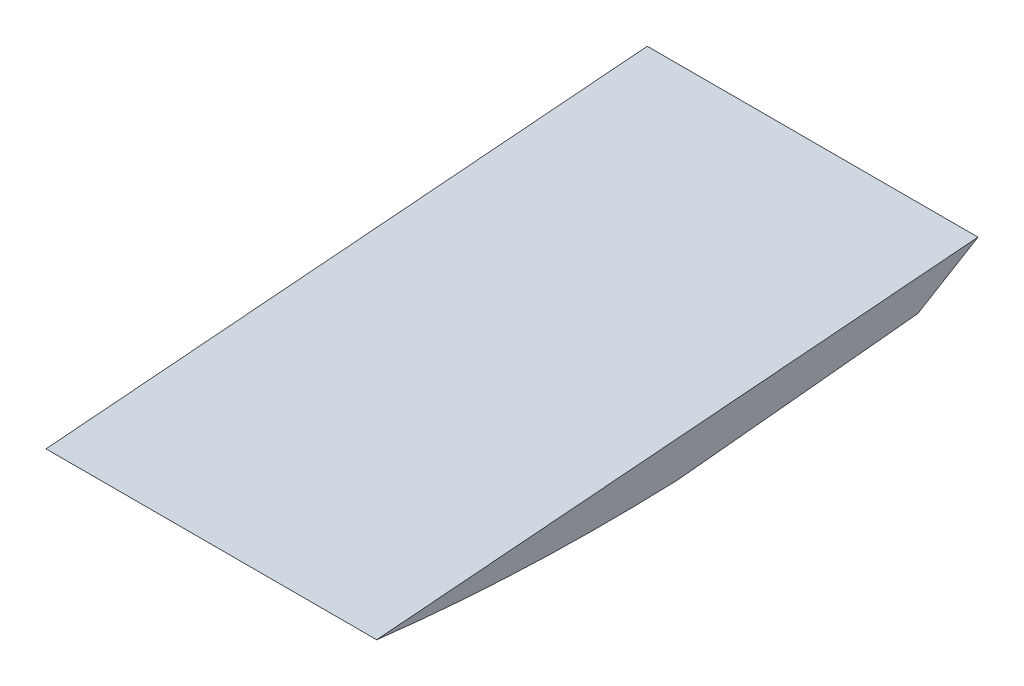
ISO-10303-21;
HEADER;
FILE_DESCRIPTION(('STEP AP214'),'2;1');
FILE_NAME('part.step','',(''),(''),'','','');
FILE_SCHEMA(('AUTOMOTIVE_DESIGN { 1 0 10303 214 1 1 1 1 }'));
ENDSEC;
DATA;
#1=APPLICATION_CONTEXT('core data for automotive mechanical design processes');
#2=APPLICATION_PROTOCOL_DEFINITION('international standard','automotive_design',2000,#1);
#3=PRODUCT_CONTEXT('',#1,'mechanical');
#4=PRODUCT('Part','Part','',(#3));
#5=PRODUCT_RELATED_PRODUCT_CATEGORY('part','',(#4));
#6=PRODUCT_DEFINITION_FORMATION('','',#4);
#7=PRODUCT_DEFINITION_CONTEXT('part definition',#1,'design');
#8=PRODUCT_DEFINITION('design','',#6,#7);
#9=PRODUCT_DEFINITION_SHAPE('','',#8);
#10=(LENGTH_UNIT() NAMED_UNIT(*) SI_UNIT(.MILLI.,.METRE.));
#11=(NAMED_UNIT(*) PLANE_ANGLE_UNIT() SI_UNIT($,.RADIAN.));
#12=(NAMED_UNIT(*) SI_UNIT($,.STERADIAN.) SOLID_ANGLE_UNIT());
#13=UNCERTAINTY_MEASURE_WITH_UNIT(LENGTH_MEASURE(1.E-05),#10,'distance_accuracy_value','');
#14=(GEOMETRIC_REPRESENTATION_CONTEXT(3) GLOBAL_UNCERTAINTY_ASSIGNED_CONTEXT((#13)) GLOBAL_UNIT_ASSIGNED_CONTEXT((#10,
#11,#12)) REPRESENTATION_CONTEXT('',''));
#15=CARTESIAN_POINT('',(0.,0.,0.));
#16=DIRECTION('',(0.,0.,1.));
#17=DIRECTION('',(1.,0.,0.));
#18=AXIS2_PLACEMENT_3D('',#15,#16,#17);
#19=CARTESIAN_POINT('',(13.75,3.,-5.));
#20=DIRECTION('',(0.,0.857492925712544,0.514495755427526));
#21=DIRECTION('',(0.,0.514495755427526,-0.857492925712544));
#22=AXIS2_PLACEMENT_3D('',#19,#20,#21);
#23=PLANE('',#22);
#24=DIRECTION('',(0.,-0.514495755427526,0.857492925712544));
#25=VECTOR('',#24,1.);
#26=CARTESIAN_POINT('',(-13.75,3.,-5.));
#27=LINE('',#26,#25);
#28=CARTESIAN_POINT('',(-13.75,3.,-5.));
#29=VERTEX_POINT('',#28);
#30=CARTESIAN_POINT('',(-13.75,0.,0.));
#31=VERTEX_POINT('',#30);
#32=EDGE_CURVE('E102',#29,#31,#27,.T.);
#33=ORIENTED_EDGE('',*,*,#32,.F.);
#34=DIRECTION('',(-1.,0.,0.));
#35=VECTOR('',#34,1.);
#36=CARTESIAN_POINT('',(13.75,3.,-5.));
#37=LINE('',#36,#35);
#38=CARTESIAN_POINT('',(13.75,3.,-5.));
#39=VERTEX_POINT('',#38);
#40=EDGE_CURVE('E101',#39,#29,#37,.T.);
#41=ORIENTED_EDGE('',*,*,#40,.F.);
#42=DIRECTION('',(0.,-0.514495755427526,0.857492925712544));
#43=VECTOR('',#42,1.);
#44=CARTESIAN_POINT('',(13.75,3.,-5.));
#45=LINE('',#44,#43);
#46=CARTESIAN_POINT('',(13.75,0.,0.));
#47=VERTEX_POINT('',#46);
#48=EDGE_CURVE('E96',#39,#47,#45,.T.);
#49=ORIENTED_EDGE('',*,*,#48,.T.);
#50=DIRECTION('',(-1.,0.,0.));
#51=VECTOR('',#50,1.);
#52=CARTESIAN_POINT('',(13.75,0.,0.));
#53=LINE('',#52,#51);
#54=EDGE_CURVE('E11',#47,#31,#53,.T.);
#55=ORIENTED_EDGE('',*,*,#54,.T.);
#56=EDGE_LOOP('',(#33,#41,#49,#55));
#57=FACE_BOUND('',#56,.T.);
#58=ADVANCED_FACE('F39',(#57),#23,.F.);
#59=CARTESIAN_POINT('',(13.75,0.,0.));
#60=DIRECTION('',(0.,0.995037190209989,0.0995037190209989));
#61=DIRECTION('',(0.,0.0995037190209989,-0.995037190209989));
#62=AXIS2_PLACEMENT_3D('',#59,#60,#61);
#63=PLANE('',#62);
#64=DIRECTION('',(0.,-0.0995037190209989,0.995037190209989));
#65=VECTOR('',#64,1.);
#66=CARTESIAN_POINT('',(-13.75,0.,0.));
#67=LINE('',#66,#65);
#68=CARTESIAN_POINT('',(-13.75,-2.,20.));
#69=VERTEX_POINT('',#68);
#70=EDGE_CURVE('E104',#31,#69,#67,.T.);
#71=ORIENTED_EDGE('',*,*,#70,.F.);
#72=ORIENTED_EDGE('',*,*,#54,.F.);
#73=DIRECTION('',(0.,-0.0995037190209989,0.995037190209989));
#74=VECTOR('',#73,1.);
#75=CARTESIAN_POINT('',(13.75,0.,0.));
#76=LINE('',#75,#74);
#77=CARTESIAN_POINT('',(13.75,-2.,20.));
#78=VERTEX_POINT('',#77);
#79=EDGE_CURVE('E80',#47,#78,#76,.T.);
#80=ORIENTED_EDGE('',*,*,#79,.T.);
#81=DIRECTION('',(-1.,0.,0.));
#82=VECTOR('',#81,1.);
#83=CARTESIAN_POINT('',(13.75,-2.,20.));
#84=LINE('',#83,#82);
#85=EDGE_CURVE('E47',#78,#69,#84,.T.);
#86=ORIENTED_EDGE('',*,*,#85,.T.);
#87=EDGE_LOOP('',(#71,#72,#80,#86));
#88=FACE_BOUND('',#87,.T.);
#89=ADVANCED_FACE('F94',(#88),#63,.F.);
#90=CARTESIAN_POINT('',(13.75,157.88434424532,26.0824719682095));
#91=DIRECTION('',(-1.,0.,0.));
#92=DIRECTION('',(0.,0.,-1.));
#93=AXIS2_PLACEMENT_3D('',#90,#91,#92);
#94=CYLINDRICAL_SURFACE('',#93,160.);
#95=CARTESIAN_POINT('',(-13.75,157.88434424532,26.0824719682095));
#96=DIRECTION('',(-1.,0.,0.));
#97=DIRECTION('',(0.,0.,-1.));
#98=AXIS2_PLACEMENT_3D('',#95,#96,#97);
#99=CIRCLE('',#98,160.);
#100=CARTESIAN_POINT('',(-13.75,-0.993367008230189,45.));
#101=VERTEX_POINT('',#100);
#102=EDGE_CURVE('E90',#69,#101,#99,.T.);
#103=ORIENTED_EDGE('',*,*,#102,.F.);
#104=ORIENTED_EDGE('',*,*,#85,.F.);
#105=CARTESIAN_POINT('',(13.75,157.88434424532,26.0824719682095));
#106=DIRECTION('',(-1.,0.,0.));
#107=DIRECTION('',(0.,0.,-1.));
#108=AXIS2_PLACEMENT_3D('',#105,#106,#107);
#109=CIRCLE('',#108,160.);
#110=CARTESIAN_POINT('',(13.75,-0.993367008230189,45.));
#111=VERTEX_POINT('',#110);
#112=EDGE_CURVE('E83',#78,#111,#109,.T.);
#113=ORIENTED_EDGE('',*,*,#112,.T.);
#114=DIRECTION('',(-1.,0.,0.));
#115=VECTOR('',#114,1.);
#116=CARTESIAN_POINT('',(13.75,-0.993367008230189,45.));
#117=LINE('',#116,#115);
#118=EDGE_CURVE('E93',#111,#101,#117,.T.);
#119=ORIENTED_EDGE('',*,*,#118,.T.);
#120=EDGE_LOOP('',(#103,#104,#113,#119));
#121=FACE_BOUND('',#120,.T.);
#122=ADVANCED_FACE('F89',(#121),#94,.T.);
#123=CARTESIAN_POINT('',(13.75,-0.993367008230173,45.));
#124=DIRECTION('',(0.,-0.996825781699711,-0.0796138237918575));
#125=DIRECTION('',(0.,-0.0796138237918575,0.996825781699711));
#126=AXIS2_PLACEMENT_3D('',#123,#124,#125);
#127=PLANE('',#126);
#128=DIRECTION('',(0.,0.0796138237918575,-0.996825781699711));
#129=VECTOR('',#128,1.);
#130=CARTESIAN_POINT('',(-13.75,-0.993367008230173,45.));
#131=LINE('',#130,#129);
#132=EDGE_CURVE('E69',#101,#29,#131,.T.);
#133=ORIENTED_EDGE('',*,*,#132,.F.);
#134=ORIENTED_EDGE('',*,*,#118,.F.);
#135=DIRECTION('',(0.,0.0796138237918575,-0.996825781699711));
#136=VECTOR('',#135,1.);
#137=CARTESIAN_POINT('',(13.75,-0.993367008230173,45.));
#138=LINE('',#137,#136);
#139=EDGE_CURVE('E55',#111,#39,#138,.T.);
#140=ORIENTED_EDGE('',*,*,#139,.T.);
#141=ORIENTED_EDGE('',*,*,#40,.T.);
#142=EDGE_LOOP('',(#133,#134,#140,#141));
#143=FACE_BOUND('',#142,.T.);
#144=ADVANCED_FACE('F113',(#143),#127,.F.);
#145=CARTESIAN_POINT('',(13.75,157.88434424532,26.0824719682095));
#146=DIRECTION('',(-1.,0.,0.));
#147=DIRECTION('',(0.,0.,-1.));
#148=AXIS2_PLACEMENT_3D('',#145,#146,#147);
#149=PLANE('',#148);
#150=ORIENTED_EDGE('',*,*,#48,.F.);
#151=ORIENTED_EDGE('',*,*,#139,.F.);
#152=ORIENTED_EDGE('',*,*,#112,.F.);
#153=ORIENTED_EDGE('',*,*,#79,.F.);
#154=EDGE_LOOP('',(#150,#151,#152,#153));
#155=FACE_BOUND('',#154,.T.);
#156=ADVANCED_FACE('F85',(#155),#149,.F.);
#157=CARTESIAN_POINT('',(-13.75,157.88434424532,26.0824719682095));
#158=DIRECTION('',(-1.,0.,0.));
#159=DIRECTION('',(0.,0.,-1.));
#160=AXIS2_PLACEMENT_3D('',#157,#158,#159);
#161=PLANE('',#160);
#162=ORIENTED_EDGE('',*,*,#32,.T.);
#163=ORIENTED_EDGE('',*,*,#70,.T.);
#164=ORIENTED_EDGE('',*,*,#102,.T.);
#165=ORIENTED_EDGE('',*,*,#132,.T.);
#166=EDGE_LOOP('',(#162,#163,#164,#165));
#167=FACE_BOUND('',#166,.T.);
#168=ADVANCED_FACE('F109',(#167),#161,.T.);
#169=CLOSED_SHELL('',(#58,#89,#122,#144,#156,#168));
#170=MANIFOLD_SOLID_BREP('B2',#169);
#171=ADVANCED_BREP_SHAPE_REPRESENTATION('',(#18,#170),#14);
#172=SHAPE_DEFINITION_REPRESENTATION(#9,#171);
ENDSEC;
END-ISO-10303-21;
